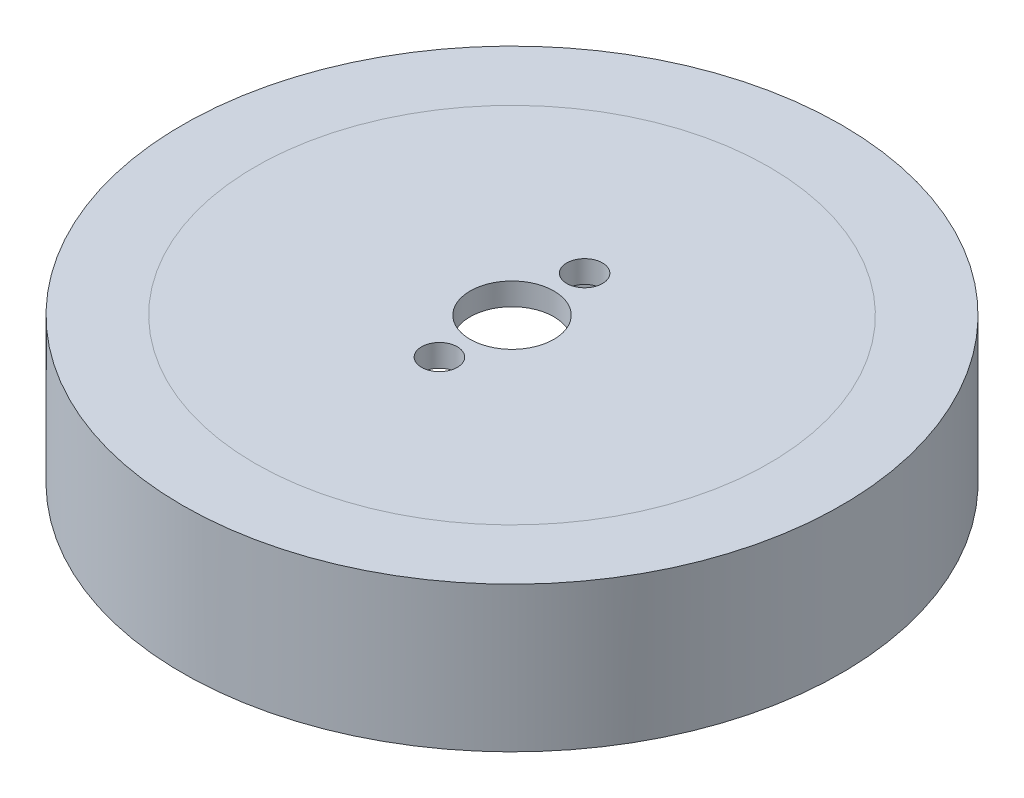
ISO-10303-21;
HEADER;
FILE_DESCRIPTION(('STEP AP214'),'2;1');
FILE_NAME('part.step','',(''),(''),'','','');
FILE_SCHEMA(('AUTOMOTIVE_DESIGN { 1 0 10303 214 1 1 1 1 }'));
ENDSEC;
DATA;
#1=APPLICATION_CONTEXT('core data for automotive mechanical design processes');
#2=APPLICATION_PROTOCOL_DEFINITION('international standard','automotive_design',2000,#1);
#3=PRODUCT_CONTEXT('',#1,'mechanical');
#4=PRODUCT('Part','Part','',(#3));
#5=PRODUCT_RELATED_PRODUCT_CATEGORY('part','',(#4));
#6=PRODUCT_DEFINITION_FORMATION('','',#4);
#7=PRODUCT_DEFINITION_CONTEXT('part definition',#1,'design');
#8=PRODUCT_DEFINITION('design','',#6,#7);
#9=PRODUCT_DEFINITION_SHAPE('','',#8);
#10=(LENGTH_UNIT() NAMED_UNIT(*) SI_UNIT(.MILLI.,.METRE.));
#11=(NAMED_UNIT(*) PLANE_ANGLE_UNIT() SI_UNIT($,.RADIAN.));
#12=(NAMED_UNIT(*) SI_UNIT($,.STERADIAN.) SOLID_ANGLE_UNIT());
#13=UNCERTAINTY_MEASURE_WITH_UNIT(LENGTH_MEASURE(1.E-05),#10,'distance_accuracy_value','');
#14=(GEOMETRIC_REPRESENTATION_CONTEXT(3) GLOBAL_UNCERTAINTY_ASSIGNED_CONTEXT((#13)) GLOBAL_UNIT_ASSIGNED_CONTEXT((#10,
#11,#12)) REPRESENTATION_CONTEXT('',''));
#15=CARTESIAN_POINT('',(0.,0.,0.));
#16=DIRECTION('',(0.,0.,1.));
#17=DIRECTION('',(1.,0.,0.));
#18=AXIS2_PLACEMENT_3D('',#15,#16,#17);
#19=CARTESIAN_POINT('',(0.,96.4386001800126,0.));
#20=DIRECTION('',(0.,-1.,0.));
#21=DIRECTION('',(0.,0.,-1.));
#22=AXIS2_PLACEMENT_3D('',#19,#20,#21);
#23=CYLINDRICAL_SURFACE('',#22,29.5);
#24=CARTESIAN_POINT('',(0.,0.,0.));
#25=DIRECTION('',(0.,-1.,0.));
#26=DIRECTION('',(0.,0.,-1.));
#27=AXIS2_PLACEMENT_3D('',#24,#25,#26);
#28=CIRCLE('',#27,29.5);
#29=CARTESIAN_POINT('',(0.,0.,-29.5));
#30=VERTEX_POINT('',#29);
#31=EDGE_CURVE('E50',#30,#30,#28,.T.);
#32=ORIENTED_EDGE('',*,*,#31,.F.);
#33=EDGE_LOOP('',(#32));
#34=FACE_BOUND('',#33,.T.);
#35=CARTESIAN_POINT('',(0.,13.,0.));
#36=DIRECTION('',(0.,1.,0.));
#37=DIRECTION('',(0.,0.,1.));
#38=AXIS2_PLACEMENT_3D('',#35,#36,#37);
#39=CIRCLE('',#38,29.5);
#40=CARTESIAN_POINT('',(0.,13.,29.5));
#41=VERTEX_POINT('',#40);
#42=EDGE_CURVE('E59',#41,#41,#39,.F.);
#43=ORIENTED_EDGE('',*,*,#42,.T.);
#44=EDGE_LOOP('',(#43));
#45=FACE_BOUND('',#44,.T.);
#46=ADVANCED_FACE('F43',(#34,#45),#23,.T.);
#47=CARTESIAN_POINT('',(0.,96.4386001800126,0.));
#48=DIRECTION('',(0.,-1.,0.));
#49=DIRECTION('',(0.,0.,-1.));
#50=AXIS2_PLACEMENT_3D('',#47,#48,#49);
#51=CYLINDRICAL_SURFACE('',#50,23.);
#52=CARTESIAN_POINT('',(0.,0.,0.));
#53=DIRECTION('',(0.,-1.,0.));
#54=DIRECTION('',(0.,0.,-1.));
#55=AXIS2_PLACEMENT_3D('',#52,#53,#54);
#56=CIRCLE('',#55,23.);
#57=CARTESIAN_POINT('',(0.,0.,-23.));
#58=VERTEX_POINT('',#57);
#59=EDGE_CURVE('E54',#58,#58,#56,.T.);
#60=ORIENTED_EDGE('',*,*,#59,.T.);
#61=EDGE_LOOP('',(#60));
#62=FACE_BOUND('',#61,.T.);
#63=CARTESIAN_POINT('',(0.,13.,0.));
#64=DIRECTION('',(0.,1.,0.));
#65=DIRECTION('',(0.,0.,1.));
#66=AXIS2_PLACEMENT_3D('',#63,#64,#65);
#67=CIRCLE('',#66,23.);
#68=CARTESIAN_POINT('',(0.,13.,23.));
#69=VERTEX_POINT('',#68);
#70=EDGE_CURVE('E11',#69,#69,#67,.F.);
#71=ORIENTED_EDGE('',*,*,#70,.F.);
#72=EDGE_LOOP('',(#71));
#73=FACE_BOUND('',#72,.T.);
#74=ADVANCED_FACE('F70',(#62,#73),#51,.F.);
#75=CARTESIAN_POINT('',(0.,0.,0.));
#76=DIRECTION('',(0.,-1.,0.));
#77=DIRECTION('',(0.,0.,-1.));
#78=AXIS2_PLACEMENT_3D('',#75,#76,#77);
#79=PLANE('',#78);
#80=ORIENTED_EDGE('',*,*,#59,.F.);
#81=EDGE_LOOP('',(#80));
#82=FACE_BOUND('',#81,.T.);
#83=ORIENTED_EDGE('',*,*,#31,.T.);
#84=EDGE_LOOP('',(#83));
#85=FACE_BOUND('',#84,.T.);
#86=ADVANCED_FACE('F66',(#82,#85),#79,.T.);
#87=CARTESIAN_POINT('',(0.,13.,0.));
#88=DIRECTION('',(0.,1.,0.));
#89=DIRECTION('',(0.,0.,1.));
#90=AXIS2_PLACEMENT_3D('',#87,#88,#89);
#91=PLANE('',#90);
#92=ORIENTED_EDGE('',*,*,#42,.F.);
#93=EDGE_LOOP('',(#92));
#94=FACE_BOUND('',#93,.T.);
#95=ORIENTED_EDGE('',*,*,#70,.T.);
#96=EDGE_LOOP('',(#95));
#97=FACE_BOUND('',#96,.T.);
#98=ADVANCED_FACE('F45',(#94,#97),#91,.T.);
#99=CLOSED_SHELL('',(#46,#74,#86,#98));
#100=MANIFOLD_SOLID_BREP('B2',#99);
#101=CARTESIAN_POINT('',(0.,13.,-6.5));
#102=DIRECTION('',(0.,-1.,0.));
#103=DIRECTION('',(0.,0.,-1.));
#104=AXIS2_PLACEMENT_3D('',#101,#102,#103);
#105=CYLINDRICAL_SURFACE('',#104,1.6);
#106=CARTESIAN_POINT('',(0.,13.,-6.5));
#107=DIRECTION('',(0.,1.,0.));
#108=DIRECTION('',(0.,0.,1.));
#109=AXIS2_PLACEMENT_3D('',#106,#107,#108);
#110=CIRCLE('',#109,1.6);
#111=CARTESIAN_POINT('',(0.,13.,-4.9));
#112=VERTEX_POINT('',#111);
#113=EDGE_CURVE('E117',#112,#112,#110,.T.);
#114=ORIENTED_EDGE('',*,*,#113,.T.);
#115=EDGE_LOOP('',(#114));
#116=FACE_BOUND('',#115,.T.);
#117=CARTESIAN_POINT('',(0.,11.,-6.5));
#118=DIRECTION('',(0.,-1.,0.));
#119=DIRECTION('',(0.,0.,-1.));
#120=AXIS2_PLACEMENT_3D('',#117,#118,#119);
#121=CIRCLE('',#120,1.6);
#122=CARTESIAN_POINT('',(0.,11.,-8.1));
#123=VERTEX_POINT('',#122);
#124=EDGE_CURVE('E127',#123,#123,#121,.T.);
#125=ORIENTED_EDGE('',*,*,#124,.T.);
#126=EDGE_LOOP('',(#125));
#127=FACE_BOUND('',#126,.T.);
#128=ADVANCED_FACE('F104',(#116,#127),#105,.F.);
#129=CARTESIAN_POINT('',(0.,13.,6.5));
#130=DIRECTION('',(0.,-1.,0.));
#131=DIRECTION('',(0.,0.,-1.));
#132=AXIS2_PLACEMENT_3D('',#129,#130,#131);
#133=CYLINDRICAL_SURFACE('',#132,1.6);
#134=CARTESIAN_POINT('',(0.,13.,6.5));
#135=DIRECTION('',(0.,1.,0.));
#136=DIRECTION('',(0.,0.,1.));
#137=AXIS2_PLACEMENT_3D('',#134,#135,#136);
#138=CIRCLE('',#137,1.6);
#139=CARTESIAN_POINT('',(0.,13.,8.1));
#140=VERTEX_POINT('',#139);
#141=EDGE_CURVE('E121',#140,#140,#138,.T.);
#142=ORIENTED_EDGE('',*,*,#141,.T.);
#143=EDGE_LOOP('',(#142));
#144=FACE_BOUND('',#143,.T.);
#145=CARTESIAN_POINT('',(0.,11.,6.5));
#146=DIRECTION('',(0.,-1.,0.));
#147=DIRECTION('',(0.,0.,-1.));
#148=AXIS2_PLACEMENT_3D('',#145,#146,#147);
#149=CIRCLE('',#148,1.6);
#150=CARTESIAN_POINT('',(0.,11.,4.9));
#151=VERTEX_POINT('',#150);
#152=EDGE_CURVE('E130',#151,#151,#149,.T.);
#153=ORIENTED_EDGE('',*,*,#152,.T.);
#154=EDGE_LOOP('',(#153));
#155=FACE_BOUND('',#154,.T.);
#156=ADVANCED_FACE('F158',(#144,#155),#133,.F.);
#157=CARTESIAN_POINT('',(0.,13.,0.));
#158=DIRECTION('',(0.,-1.,0.));
#159=DIRECTION('',(0.,0.,-1.));
#160=AXIS2_PLACEMENT_3D('',#157,#158,#159);
#161=CYLINDRICAL_SURFACE('',#160,3.75);
#162=CARTESIAN_POINT('',(0.,13.,0.));
#163=DIRECTION('',(0.,1.,0.));
#164=DIRECTION('',(0.,0.,1.));
#165=AXIS2_PLACEMENT_3D('',#162,#163,#164);
#166=CIRCLE('',#165,3.75);
#167=CARTESIAN_POINT('',(0.,13.,3.75));
#168=VERTEX_POINT('',#167);
#169=EDGE_CURVE('E124',#168,#168,#166,.T.);
#170=ORIENTED_EDGE('',*,*,#169,.T.);
#171=EDGE_LOOP('',(#170));
#172=FACE_BOUND('',#171,.T.);
#173=CARTESIAN_POINT('',(0.,11.,0.));
#174=DIRECTION('',(0.,-1.,0.));
#175=DIRECTION('',(0.,0.,-1.));
#176=AXIS2_PLACEMENT_3D('',#173,#174,#175);
#177=CIRCLE('',#176,3.75);
#178=CARTESIAN_POINT('',(0.,11.,-3.75));
#179=VERTEX_POINT('',#178);
#180=EDGE_CURVE('E108',#179,#179,#177,.T.);
#181=ORIENTED_EDGE('',*,*,#180,.T.);
#182=EDGE_LOOP('',(#181));
#183=FACE_BOUND('',#182,.T.);
#184=ADVANCED_FACE('F143',(#172,#183),#161,.F.);
#185=CARTESIAN_POINT('',(0.,13.,0.));
#186=DIRECTION('',(0.,1.,0.));
#187=DIRECTION('',(0.,0.,1.));
#188=AXIS2_PLACEMENT_3D('',#185,#186,#187);
#189=PLANE('',#188);
#190=ORIENTED_EDGE('',*,*,#141,.F.);
#191=EDGE_LOOP('',(#190));
#192=FACE_BOUND('',#191,.T.);
#193=CARTESIAN_POINT('',(0.,13.,0.));
#194=DIRECTION('',(0.,1.,0.));
#195=DIRECTION('',(0.,0.,1.));
#196=AXIS2_PLACEMENT_3D('',#193,#194,#195);
#197=CIRCLE('',#196,23.);
#198=CARTESIAN_POINT('',(0.,13.,23.));
#199=VERTEX_POINT('',#198);
#200=EDGE_CURVE('E42',#199,#199,#197,.T.);
#201=ORIENTED_EDGE('',*,*,#200,.T.);
#202=EDGE_LOOP('',(#201));
#203=FACE_BOUND('',#202,.T.);
#204=ORIENTED_EDGE('',*,*,#113,.F.);
#205=EDGE_LOOP('',(#204));
#206=FACE_BOUND('',#205,.T.);
#207=ORIENTED_EDGE('',*,*,#169,.F.);
#208=EDGE_LOOP('',(#207));
#209=FACE_BOUND('',#208,.T.);
#210=ADVANCED_FACE('F169',(#192,#203,#206,#209),#189,.T.);
#211=CARTESIAN_POINT('',(0.,0.,0.));
#212=DIRECTION('',(0.,1.,0.));
#213=DIRECTION('',(0.,0.,1.));
#214=AXIS2_PLACEMENT_3D('',#211,#212,#213);
#215=PLANE('',#214);
#216=CARTESIAN_POINT('',(0.,0.,0.));
#217=DIRECTION('',(0.,-1.,0.));
#218=DIRECTION('',(0.,0.,-1.));
#219=AXIS2_PLACEMENT_3D('',#216,#217,#218);
#220=CIRCLE('',#219,21.);
#221=CARTESIAN_POINT('',(0.,0.,-21.));
#222=VERTEX_POINT('',#221);
#223=EDGE_CURVE('E133',#222,#222,#220,.T.);
#224=ORIENTED_EDGE('',*,*,#223,.F.);
#225=EDGE_LOOP('',(#224));
#226=FACE_BOUND('',#225,.T.);
#227=CARTESIAN_POINT('',(0.,0.,0.));
#228=DIRECTION('',(0.,1.,0.));
#229=DIRECTION('',(0.,0.,1.));
#230=AXIS2_PLACEMENT_3D('',#227,#228,#229);
#231=CIRCLE('',#230,23.);
#232=CARTESIAN_POINT('',(0.,0.,23.));
#233=VERTEX_POINT('',#232);
#234=EDGE_CURVE('E112',#233,#233,#231,.T.);
#235=ORIENTED_EDGE('',*,*,#234,.F.);
#236=EDGE_LOOP('',(#235));
#237=FACE_BOUND('',#236,.T.);
#238=ADVANCED_FACE('F171',(#226,#237),#215,.F.);
#239=CARTESIAN_POINT('',(0.,13.,0.));
#240=DIRECTION('',(0.,-1.,0.));
#241=DIRECTION('',(0.,0.,-1.));
#242=AXIS2_PLACEMENT_3D('',#239,#240,#241);
#243=CYLINDRICAL_SURFACE('',#242,23.);
#244=ORIENTED_EDGE('',*,*,#200,.F.);
#245=EDGE_LOOP('',(#244));
#246=FACE_BOUND('',#245,.T.);
#247=ORIENTED_EDGE('',*,*,#234,.T.);
#248=EDGE_LOOP('',(#247));
#249=FACE_BOUND('',#248,.T.);
#250=ADVANCED_FACE('F106',(#246,#249),#243,.T.);
#251=CARTESIAN_POINT('',(0.,11.,0.));
#252=DIRECTION('',(0.,-1.,0.));
#253=DIRECTION('',(0.,0.,-1.));
#254=AXIS2_PLACEMENT_3D('',#251,#252,#253);
#255=CYLINDRICAL_SURFACE('',#254,21.);
#256=CARTESIAN_POINT('',(0.,11.,0.));
#257=DIRECTION('',(0.,-1.,0.));
#258=DIRECTION('',(0.,0.,-1.));
#259=AXIS2_PLACEMENT_3D('',#256,#257,#258);
#260=CIRCLE('',#259,21.);
#261=CARTESIAN_POINT('',(0.,11.,-21.));
#262=VERTEX_POINT('',#261);
#263=EDGE_CURVE('E136',#262,#262,#260,.T.);
#264=ORIENTED_EDGE('',*,*,#263,.F.);
#265=EDGE_LOOP('',(#264));
#266=FACE_BOUND('',#265,.T.);
#267=ORIENTED_EDGE('',*,*,#223,.T.);
#268=EDGE_LOOP('',(#267));
#269=FACE_BOUND('',#268,.T.);
#270=ADVANCED_FACE('F147',(#266,#269),#255,.F.);
#271=CARTESIAN_POINT('',(0.,11.,0.));
#272=DIRECTION('',(0.,-1.,0.));
#273=DIRECTION('',(0.,0.,-1.));
#274=AXIS2_PLACEMENT_3D('',#271,#272,#273);
#275=PLANE('',#274);
#276=ORIENTED_EDGE('',*,*,#124,.F.);
#277=EDGE_LOOP('',(#276));
#278=FACE_BOUND('',#277,.T.);
#279=ORIENTED_EDGE('',*,*,#152,.F.);
#280=EDGE_LOOP('',(#279));
#281=FACE_BOUND('',#280,.T.);
#282=ORIENTED_EDGE('',*,*,#180,.F.);
#283=EDGE_LOOP('',(#282));
#284=FACE_BOUND('',#283,.T.);
#285=ORIENTED_EDGE('',*,*,#263,.T.);
#286=EDGE_LOOP('',(#285));
#287=FACE_BOUND('',#286,.T.);
#288=ADVANCED_FACE('F145',(#278,#281,#284,#287),#275,.T.);
#289=CLOSED_SHELL('',(#128,#156,#184,#210,#238,#250,#270,#288));
#290=MANIFOLD_SOLID_BREP('B6',#289);
#291=ADVANCED_BREP_SHAPE_REPRESENTATION('',(#18,#100,#290),#14);
#292=SHAPE_DEFINITION_REPRESENTATION(#9,#291);
ENDSEC;
END-ISO-10303-21;
